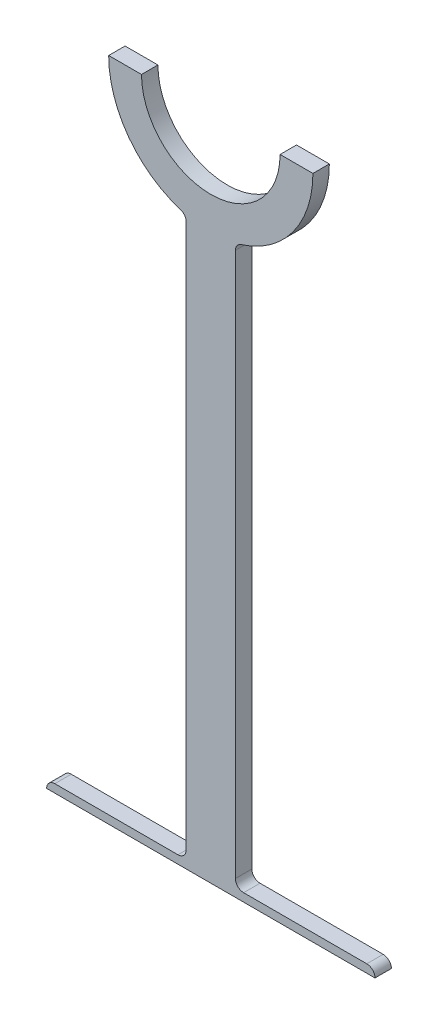
ISO-10303-21;
HEADER;
FILE_DESCRIPTION(('STEP AP214'),'2;1');
FILE_NAME('part.step','',(''),(''),'','','');
FILE_SCHEMA(('AUTOMOTIVE_DESIGN { 1 0 10303 214 1 1 1 1 }'));
ENDSEC;
DATA;
#1=APPLICATION_CONTEXT('core data for automotive mechanical design processes');
#2=APPLICATION_PROTOCOL_DEFINITION('international standard','automotive_design',2000,#1);
#3=PRODUCT_CONTEXT('',#1,'mechanical');
#4=PRODUCT('Part','Part','',(#3));
#5=PRODUCT_RELATED_PRODUCT_CATEGORY('part','',(#4));
#6=PRODUCT_DEFINITION_FORMATION('','',#4);
#7=PRODUCT_DEFINITION_CONTEXT('part definition',#1,'design');
#8=PRODUCT_DEFINITION('design','',#6,#7);
#9=PRODUCT_DEFINITION_SHAPE('','',#8);
#10=(LENGTH_UNIT() NAMED_UNIT(*) SI_UNIT(.MILLI.,.METRE.));
#11=(NAMED_UNIT(*) PLANE_ANGLE_UNIT() SI_UNIT($,.RADIAN.));
#12=(NAMED_UNIT(*) SI_UNIT($,.STERADIAN.) SOLID_ANGLE_UNIT());
#13=UNCERTAINTY_MEASURE_WITH_UNIT(LENGTH_MEASURE(1.E-05),#10,'distance_accuracy_value','');
#14=(GEOMETRIC_REPRESENTATION_CONTEXT(3) GLOBAL_UNCERTAINTY_ASSIGNED_CONTEXT((#13)) GLOBAL_UNIT_ASSIGNED_CONTEXT((#10,
#11,#12)) REPRESENTATION_CONTEXT('',''));
#15=CARTESIAN_POINT('',(0.,0.,0.));
#16=DIRECTION('',(0.,0.,1.));
#17=DIRECTION('',(1.,0.,0.));
#18=AXIS2_PLACEMENT_3D('',#15,#16,#17);
#19=CARTESIAN_POINT('',(0.,0.,2.5));
#20=DIRECTION('',(0.,0.,-1.));
#21=DIRECTION('',(-1.,0.,0.));
#22=AXIS2_PLACEMENT_3D('',#19,#20,#21);
#23=CYLINDRICAL_SURFACE('',#22,31.1);
#24=CARTESIAN_POINT('',(0.,0.,2.5));
#25=DIRECTION('',(0.,0.,1.));
#26=DIRECTION('',(1.,0.,0.));
#27=AXIS2_PLACEMENT_3D('',#24,#25,#26);
#28=CIRCLE('',#27,31.1);
#29=CARTESIAN_POINT('',(9.25595238095238,-29.6906945947976,2.5));
#30=VERTEX_POINT('',#29);
#31=CARTESIAN_POINT('',(31.1,0.,2.5));
#32=VERTEX_POINT('',#31);
#33=EDGE_CURVE('E214',#30,#32,#28,.T.);
#34=ORIENTED_EDGE('',*,*,#33,.F.);
#35=DIRECTION('',(0.,0.,-1.));
#36=VECTOR('',#35,1.);
#37=CARTESIAN_POINT('',(9.25595238095238,-29.6906945947976,2.5));
#38=LINE('',#37,#36);
#39=CARTESIAN_POINT('',(9.25595238095238,-29.6906945947976,-2.5));
#40=VERTEX_POINT('',#39);
#41=EDGE_CURVE('E284',#30,#40,#38,.T.);
#42=ORIENTED_EDGE('',*,*,#41,.T.);
#43=CARTESIAN_POINT('',(0.,0.,-2.5));
#44=DIRECTION('',(0.,0.,1.));
#45=DIRECTION('',(1.,0.,0.));
#46=AXIS2_PLACEMENT_3D('',#43,#44,#45);
#47=CIRCLE('',#46,31.1);
#48=CARTESIAN_POINT('',(31.1,0.,-2.5));
#49=VERTEX_POINT('',#48);
#50=EDGE_CURVE('E229',#40,#49,#47,.T.);
#51=ORIENTED_EDGE('',*,*,#50,.T.);
#52=DIRECTION('',(0.,0.,-1.));
#53=VECTOR('',#52,1.);
#54=CARTESIAN_POINT('',(31.1,0.,2.5));
#55=LINE('',#54,#53);
#56=EDGE_CURVE('E239',#32,#49,#55,.T.);
#57=ORIENTED_EDGE('',*,*,#56,.F.);
#58=EDGE_LOOP('',(#34,#42,#51,#57));
#59=FACE_BOUND('',#58,.T.);
#60=ADVANCED_FACE('F39',(#59),#23,.T.);
#61=CARTESIAN_POINT('',(-31.1,0.,-2.5));
#62=VERTEX_POINT('',#61);
#63=CARTESIAN_POINT('',(-9.25595238095238,-29.6906945947976,-2.5));
#64=VERTEX_POINT('',#63);
#65=EDGE_CURVE('E230',#62,#64,#47,.T.);
#66=ORIENTED_EDGE('',*,*,#65,.T.);
#67=DIRECTION('',(0.,0.,-1.));
#68=VECTOR('',#67,1.);
#69=CARTESIAN_POINT('',(-9.25595238095238,-29.6906945947976,2.5));
#70=LINE('',#69,#68);
#71=CARTESIAN_POINT('',(-9.25595238095238,-29.6906945947976,2.5));
#72=VERTEX_POINT('',#71);
#73=EDGE_CURVE('E297',#64,#72,#70,.F.);
#74=ORIENTED_EDGE('',*,*,#73,.T.);
#75=CARTESIAN_POINT('',(-31.1,0.,2.5));
#76=VERTEX_POINT('',#75);
#77=EDGE_CURVE('E215',#76,#72,#28,.T.);
#78=ORIENTED_EDGE('',*,*,#77,.F.);
#79=DIRECTION('',(0.,0.,-1.));
#80=VECTOR('',#79,1.);
#81=CARTESIAN_POINT('',(-31.1,0.,2.5));
#82=LINE('',#81,#80);
#83=EDGE_CURVE('E243',#76,#62,#82,.T.);
#84=ORIENTED_EDGE('',*,*,#83,.T.);
#85=EDGE_LOOP('',(#66,#74,#78,#84));
#86=FACE_BOUND('',#85,.T.);
#87=ADVANCED_FACE('F356',(#86),#23,.T.);
#88=CARTESIAN_POINT('',(0.,0.,2.5));
#89=DIRECTION('',(0.,0.,-1.));
#90=DIRECTION('',(-1.,0.,0.));
#91=AXIS2_PLACEMENT_3D('',#88,#89,#90);
#92=CYLINDRICAL_SURFACE('',#91,21.1);
#93=CARTESIAN_POINT('',(0.,0.,-2.5));
#94=DIRECTION('',(0.,0.,-1.));
#95=DIRECTION('',(1.,0.,0.));
#96=AXIS2_PLACEMENT_3D('',#93,#94,#95);
#97=CIRCLE('',#96,21.1);
#98=CARTESIAN_POINT('',(21.1,0.,-2.5));
#99=VERTEX_POINT('',#98);
#100=CARTESIAN_POINT('',(-21.1,0.,-2.5));
#101=VERTEX_POINT('',#100);
#102=EDGE_CURVE('E171',#99,#101,#97,.T.);
#103=ORIENTED_EDGE('',*,*,#102,.T.);
#104=DIRECTION('',(0.,0.,-1.));
#105=VECTOR('',#104,1.);
#106=CARTESIAN_POINT('',(-21.1,0.,2.5));
#107=LINE('',#106,#105);
#108=CARTESIAN_POINT('',(-21.1,0.,2.5));
#109=VERTEX_POINT('',#108);
#110=EDGE_CURVE('E247',#109,#101,#107,.T.);
#111=ORIENTED_EDGE('',*,*,#110,.F.);
#112=CARTESIAN_POINT('',(0.,0.,2.5));
#113=DIRECTION('',(0.,0.,-1.));
#114=DIRECTION('',(1.,0.,0.));
#115=AXIS2_PLACEMENT_3D('',#112,#113,#114);
#116=CIRCLE('',#115,21.1);
#117=CARTESIAN_POINT('',(21.1,0.,2.5));
#118=VERTEX_POINT('',#117);
#119=EDGE_CURVE('E206',#118,#109,#116,.T.);
#120=ORIENTED_EDGE('',*,*,#119,.F.);
#121=DIRECTION('',(0.,0.,-1.));
#122=VECTOR('',#121,1.);
#123=CARTESIAN_POINT('',(21.1,0.,2.5));
#124=LINE('',#123,#122);
#125=EDGE_CURVE('E222',#118,#99,#124,.T.);
#126=ORIENTED_EDGE('',*,*,#125,.T.);
#127=EDGE_LOOP('',(#103,#111,#120,#126));
#128=FACE_BOUND('',#127,.T.);
#129=ADVANCED_FACE('F349',(#128),#92,.F.);
#130=CARTESIAN_POINT('',(-21.1,0.,2.5));
#131=DIRECTION('',(0.,-1.,0.));
#132=DIRECTION('',(1.,0.,0.));
#133=AXIS2_PLACEMENT_3D('',#130,#131,#132);
#134=PLANE('',#133);
#135=DIRECTION('',(-1.,0.,0.));
#136=VECTOR('',#135,1.);
#137=CARTESIAN_POINT('',(-21.1,0.,-2.5));
#138=LINE('',#137,#136);
#139=EDGE_CURVE('E226',#101,#62,#138,.T.);
#140=ORIENTED_EDGE('',*,*,#139,.T.);
#141=ORIENTED_EDGE('',*,*,#83,.F.);
#142=DIRECTION('',(-1.,0.,0.));
#143=VECTOR('',#142,1.);
#144=CARTESIAN_POINT('',(-21.1,0.,2.5));
#145=LINE('',#144,#143);
#146=EDGE_CURVE('E210',#109,#76,#145,.T.);
#147=ORIENTED_EDGE('',*,*,#146,.F.);
#148=ORIENTED_EDGE('',*,*,#110,.T.);
#149=EDGE_LOOP('',(#140,#141,#147,#148));
#150=FACE_BOUND('',#149,.T.);
#151=ADVANCED_FACE('F352',(#150),#134,.F.);
#152=CARTESIAN_POINT('',(21.1,0.,2.5));
#153=DIRECTION('',(0.,-1.,0.));
#154=DIRECTION('',(0.,0.,-1.));
#155=AXIS2_PLACEMENT_3D('',#152,#153,#154);
#156=PLANE('',#155);
#157=DIRECTION('',(-1.,0.,0.));
#158=VECTOR('',#157,1.);
#159=CARTESIAN_POINT('',(21.1,0.,-2.5));
#160=LINE('',#159,#158);
#161=EDGE_CURVE('E211',#49,#99,#160,.T.);
#162=ORIENTED_EDGE('',*,*,#161,.T.);
#163=ORIENTED_EDGE('',*,*,#125,.F.);
#164=DIRECTION('',(-1.,0.,0.));
#165=VECTOR('',#164,1.);
#166=CARTESIAN_POINT('',(21.1,0.,2.5));
#167=LINE('',#166,#165);
#168=EDGE_CURVE('E219',#32,#118,#167,.T.);
#169=ORIENTED_EDGE('',*,*,#168,.F.);
#170=ORIENTED_EDGE('',*,*,#56,.T.);
#171=EDGE_LOOP('',(#162,#163,#169,#170));
#172=FACE_BOUND('',#171,.T.);
#173=ADVANCED_FACE('F344',(#172),#156,.F.);
#174=CARTESIAN_POINT('',(0.,0.,2.5));
#175=DIRECTION('',(0.,0.,1.));
#176=DIRECTION('',(1.,0.,0.));
#177=AXIS2_PLACEMENT_3D('',#174,#175,#176);
#178=PLANE('',#177);
#179=DIRECTION('',(1.,0.,0.));
#180=VECTOR('',#179,1.);
#181=CARTESIAN_POINT('',(-50.,-200.239187587837,2.5));
#182=LINE('',#181,#180);
#183=CARTESIAN_POINT('',(-47.5,-200.239187587837,2.5));
#184=VERTEX_POINT('',#183);
#185=CARTESIAN_POINT('',(-10.,-200.239187587837,2.5));
#186=VERTEX_POINT('',#185);
#187=EDGE_CURVE('E184',#184,#186,#182,.T.);
#188=ORIENTED_EDGE('',*,*,#187,.F.);
#189=CARTESIAN_POINT('',(-47.5,-202.739187587837,2.5));
#190=DIRECTION('',(0.,0.,1.));
#191=DIRECTION('',(1.,0.,0.));
#192=AXIS2_PLACEMENT_3D('',#189,#190,#191);
#193=CIRCLE('',#192,2.5);
#194=CARTESIAN_POINT('',(-50.,-202.739187587837,2.5));
#195=VERTEX_POINT('',#194);
#196=EDGE_CURVE('E48',#184,#195,#193,.T.);
#197=ORIENTED_EDGE('',*,*,#196,.T.);
#198=DIRECTION('',(1.,0.,0.));
#199=VECTOR('',#198,1.);
#200=CARTESIAN_POINT('',(-7.5,-202.739187587837,2.5));
#201=LINE('',#200,#199);
#202=CARTESIAN_POINT('',(50.,-202.739187587837,2.5));
#203=VERTEX_POINT('',#202);
#204=EDGE_CURVE('E165',#195,#203,#201,.T.);
#205=ORIENTED_EDGE('',*,*,#204,.T.);
#206=CARTESIAN_POINT('',(47.5,-202.739187587837,2.5));
#207=DIRECTION('',(0.,0.,1.));
#208=DIRECTION('',(1.,0.,0.));
#209=AXIS2_PLACEMENT_3D('',#206,#207,#208);
#210=CIRCLE('',#209,2.5);
#211=CARTESIAN_POINT('',(47.5,-200.239187587837,2.5));
#212=VERTEX_POINT('',#211);
#213=EDGE_CURVE('E151',#203,#212,#210,.T.);
#214=ORIENTED_EDGE('',*,*,#213,.T.);
#215=CARTESIAN_POINT('',(10.,-200.239187587837,2.5));
#216=VERTEX_POINT('',#215);
#217=EDGE_CURVE('E188',#216,#212,#182,.T.);
#218=ORIENTED_EDGE('',*,*,#217,.F.);
#219=CARTESIAN_POINT('',(10.,-197.739187587837,2.5));
#220=DIRECTION('',(0.,0.,1.));
#221=DIRECTION('',(1.,0.,0.));
#222=AXIS2_PLACEMENT_3D('',#219,#220,#221);
#223=CIRCLE('',#222,2.5);
#224=CARTESIAN_POINT('',(7.5,-197.739187587837,2.5));
#225=VERTEX_POINT('',#224);
#226=EDGE_CURVE('E261',#216,#225,#223,.F.);
#227=ORIENTED_EDGE('',*,*,#226,.T.);
#228=DIRECTION('',(0.,1.,0.));
#229=VECTOR('',#228,1.);
#230=CARTESIAN_POINT('',(7.5,-202.739187587837,2.5));
#231=LINE('',#230,#229);
#232=CARTESIAN_POINT('',(7.5,-32.0774063789453,2.5));
#233=VERTEX_POINT('',#232);
#234=EDGE_CURVE('E192',#225,#233,#231,.T.);
#235=ORIENTED_EDGE('',*,*,#234,.T.);
#236=CARTESIAN_POINT('',(10.,-32.0774063789453,2.5));
#237=DIRECTION('',(0.,0.,1.));
#238=DIRECTION('',(1.,0.,0.));
#239=AXIS2_PLACEMENT_3D('',#236,#237,#238);
#240=CIRCLE('',#239,2.5);
#241=EDGE_CURVE('E287',#233,#30,#240,.F.);
#242=ORIENTED_EDGE('',*,*,#241,.T.);
#243=ORIENTED_EDGE('',*,*,#33,.T.);
#244=ORIENTED_EDGE('',*,*,#168,.T.);
#245=ORIENTED_EDGE('',*,*,#119,.T.);
#246=ORIENTED_EDGE('',*,*,#146,.T.);
#247=ORIENTED_EDGE('',*,*,#77,.T.);
#248=CARTESIAN_POINT('',(-10.,-32.0774063789453,2.5));
#249=DIRECTION('',(0.,0.,1.));
#250=DIRECTION('',(1.,0.,0.));
#251=AXIS2_PLACEMENT_3D('',#248,#249,#250);
#252=CIRCLE('',#251,2.5);
#253=CARTESIAN_POINT('',(-7.5,-32.0774063789453,2.5));
#254=VERTEX_POINT('',#253);
#255=EDGE_CURVE('E162',#72,#254,#252,.F.);
#256=ORIENTED_EDGE('',*,*,#255,.T.);
#257=DIRECTION('',(0.,-1.,0.));
#258=VECTOR('',#257,1.);
#259=CARTESIAN_POINT('',(-7.5,-202.739187587837,2.5));
#260=LINE('',#259,#258);
#261=CARTESIAN_POINT('',(-7.5,-197.739187587837,2.5));
#262=VERTEX_POINT('',#261);
#263=EDGE_CURVE('E172',#254,#262,#260,.T.);
#264=ORIENTED_EDGE('',*,*,#263,.T.);
#265=CARTESIAN_POINT('',(-10.,-197.739187587837,2.5));
#266=DIRECTION('',(0.,0.,1.));
#267=DIRECTION('',(1.,0.,0.));
#268=AXIS2_PLACEMENT_3D('',#265,#266,#267);
#269=CIRCLE('',#268,2.5);
#270=EDGE_CURVE('E272',#262,#186,#269,.F.);
#271=ORIENTED_EDGE('',*,*,#270,.T.);
#272=EDGE_LOOP('',(#188,#197,#205,#214,#218,#227,#235,#242,#243,#244,#245,#246,#247,#256,#264,#271));
#273=FACE_BOUND('',#272,.T.);
#274=ADVANCED_FACE('F167',(#273),#178,.T.);
#275=CARTESIAN_POINT('',(0.,0.,-2.5));
#276=DIRECTION('',(0.,0.,1.));
#277=DIRECTION('',(1.,0.,0.));
#278=AXIS2_PLACEMENT_3D('',#275,#276,#277);
#279=PLANE('',#278);
#280=DIRECTION('',(1.,0.,0.));
#281=VECTOR('',#280,1.);
#282=CARTESIAN_POINT('',(-7.5,-202.739187587837,-2.5));
#283=LINE('',#282,#281);
#284=CARTESIAN_POINT('',(-50.,-202.739187587837,-2.5));
#285=VERTEX_POINT('',#284);
#286=CARTESIAN_POINT('',(50.,-202.739187587837,-2.5));
#287=VERTEX_POINT('',#286);
#288=EDGE_CURVE('E176',#285,#287,#283,.T.);
#289=ORIENTED_EDGE('',*,*,#288,.F.);
#290=CARTESIAN_POINT('',(-47.5,-202.739187587837,-2.5));
#291=DIRECTION('',(0.,0.,1.));
#292=DIRECTION('',(1.,0.,0.));
#293=AXIS2_PLACEMENT_3D('',#290,#291,#292);
#294=CIRCLE('',#293,2.5);
#295=CARTESIAN_POINT('',(-47.5,-200.239187587837,-2.5));
#296=VERTEX_POINT('',#295);
#297=EDGE_CURVE('E11',#285,#296,#294,.F.);
#298=ORIENTED_EDGE('',*,*,#297,.T.);
#299=DIRECTION('',(1.,0.,0.));
#300=VECTOR('',#299,1.);
#301=CARTESIAN_POINT('',(-50.,-200.239187587837,-2.5));
#302=LINE('',#301,#300);
#303=CARTESIAN_POINT('',(-10.,-200.239187587837,-2.5));
#304=VERTEX_POINT('',#303);
#305=EDGE_CURVE('E189',#296,#304,#302,.T.);
#306=ORIENTED_EDGE('',*,*,#305,.T.);
#307=CARTESIAN_POINT('',(-10.,-197.739187587837,-2.5));
#308=DIRECTION('',(0.,0.,1.));
#309=DIRECTION('',(1.,0.,0.));
#310=AXIS2_PLACEMENT_3D('',#307,#308,#309);
#311=CIRCLE('',#310,2.5);
#312=CARTESIAN_POINT('',(-7.5,-197.739187587837,-2.5));
#313=VERTEX_POINT('',#312);
#314=EDGE_CURVE('E276',#304,#313,#311,.T.);
#315=ORIENTED_EDGE('',*,*,#314,.T.);
#316=DIRECTION('',(0.,-1.,0.));
#317=VECTOR('',#316,1.);
#318=CARTESIAN_POINT('',(-7.5,-202.739187587837,-2.5));
#319=LINE('',#318,#317);
#320=CARTESIAN_POINT('',(-7.5,-32.0774063789453,-2.5));
#321=VERTEX_POINT('',#320);
#322=EDGE_CURVE('E201',#321,#313,#319,.T.);
#323=ORIENTED_EDGE('',*,*,#322,.F.);
#324=CARTESIAN_POINT('',(-10.,-32.0774063789453,-2.5));
#325=DIRECTION('',(0.,0.,1.));
#326=DIRECTION('',(1.,0.,0.));
#327=AXIS2_PLACEMENT_3D('',#324,#325,#326);
#328=CIRCLE('',#327,2.5);
#329=EDGE_CURVE('E300',#321,#64,#328,.T.);
#330=ORIENTED_EDGE('',*,*,#329,.T.);
#331=ORIENTED_EDGE('',*,*,#65,.F.);
#332=ORIENTED_EDGE('',*,*,#139,.F.);
#333=ORIENTED_EDGE('',*,*,#102,.F.);
#334=ORIENTED_EDGE('',*,*,#161,.F.);
#335=ORIENTED_EDGE('',*,*,#50,.F.);
#336=CARTESIAN_POINT('',(10.,-32.0774063789453,-2.5));
#337=DIRECTION('',(0.,0.,1.));
#338=DIRECTION('',(1.,0.,0.));
#339=AXIS2_PLACEMENT_3D('',#336,#337,#338);
#340=CIRCLE('',#339,2.5);
#341=CARTESIAN_POINT('',(7.5,-32.0774063789453,-2.5));
#342=VERTEX_POINT('',#341);
#343=EDGE_CURVE('E290',#40,#342,#340,.T.);
#344=ORIENTED_EDGE('',*,*,#343,.T.);
#345=DIRECTION('',(0.,1.,0.));
#346=VECTOR('',#345,1.);
#347=CARTESIAN_POINT('',(7.5,-202.739187587837,-2.5));
#348=LINE('',#347,#346);
#349=CARTESIAN_POINT('',(7.5,-197.739187587837,-2.5));
#350=VERTEX_POINT('',#349);
#351=EDGE_CURVE('E187',#350,#342,#348,.T.);
#352=ORIENTED_EDGE('',*,*,#351,.F.);
#353=CARTESIAN_POINT('',(10.,-197.739187587837,-2.5));
#354=DIRECTION('',(0.,0.,1.));
#355=DIRECTION('',(1.,0.,0.));
#356=AXIS2_PLACEMENT_3D('',#353,#354,#355);
#357=CIRCLE('',#356,2.5);
#358=CARTESIAN_POINT('',(10.,-200.239187587837,-2.5));
#359=VERTEX_POINT('',#358);
#360=EDGE_CURVE('E258',#350,#359,#357,.T.);
#361=ORIENTED_EDGE('',*,*,#360,.T.);
#362=CARTESIAN_POINT('',(47.5,-200.239187587837,-2.5));
#363=VERTEX_POINT('',#362);
#364=EDGE_CURVE('E181',#359,#363,#302,.T.);
#365=ORIENTED_EDGE('',*,*,#364,.T.);
#366=CARTESIAN_POINT('',(47.5,-202.739187587837,-2.5));
#367=DIRECTION('',(0.,0.,1.));
#368=DIRECTION('',(1.,0.,0.));
#369=AXIS2_PLACEMENT_3D('',#366,#367,#368);
#370=CIRCLE('',#369,2.5);
#371=EDGE_CURVE('E307',#363,#287,#370,.F.);
#372=ORIENTED_EDGE('',*,*,#371,.T.);
#373=EDGE_LOOP('',(#289,#298,#306,#315,#323,#330,#331,#332,#333,#334,#335,#344,#352,#361,#365,#372));
#374=FACE_BOUND('',#373,.T.);
#375=ADVANCED_FACE('F319',(#374),#279,.F.);
#376=CARTESIAN_POINT('',(7.5,-202.739187587837,2.5));
#377=DIRECTION('',(-1.,0.,0.));
#378=DIRECTION('',(0.,0.,1.));
#379=AXIS2_PLACEMENT_3D('',#376,#377,#378);
#380=PLANE('',#379);
#381=ORIENTED_EDGE('',*,*,#351,.T.);
#382=DIRECTION('',(0.,0.,1.));
#383=VECTOR('',#382,1.);
#384=CARTESIAN_POINT('',(7.5,-32.0774063789453,2.5));
#385=LINE('',#384,#383);
#386=EDGE_CURVE('E280',#342,#233,#385,.T.);
#387=ORIENTED_EDGE('',*,*,#386,.T.);
#388=ORIENTED_EDGE('',*,*,#234,.F.);
#389=DIRECTION('',(0.,0.,-1.));
#390=VECTOR('',#389,1.);
#391=CARTESIAN_POINT('',(7.5,-197.739187587837,2.5));
#392=LINE('',#391,#390);
#393=EDGE_CURVE('E251',#225,#350,#392,.T.);
#394=ORIENTED_EDGE('',*,*,#393,.T.);
#395=EDGE_LOOP('',(#381,#387,#388,#394));
#396=FACE_BOUND('',#395,.T.);
#397=ADVANCED_FACE('F330',(#396),#380,.F.);
#398=CARTESIAN_POINT('',(-7.5,-202.739187587837,2.5));
#399=DIRECTION('',(1.,0.,0.));
#400=DIRECTION('',(0.,0.,-1.));
#401=AXIS2_PLACEMENT_3D('',#398,#399,#400);
#402=PLANE('',#401);
#403=ORIENTED_EDGE('',*,*,#263,.F.);
#404=DIRECTION('',(0.,0.,1.));
#405=VECTOR('',#404,1.);
#406=CARTESIAN_POINT('',(-7.5,-32.0774063789453,-2.5));
#407=LINE('',#406,#405);
#408=EDGE_CURVE('E293',#254,#321,#407,.F.);
#409=ORIENTED_EDGE('',*,*,#408,.T.);
#410=ORIENTED_EDGE('',*,*,#322,.T.);
#411=DIRECTION('',(0.,0.,1.));
#412=VECTOR('',#411,1.);
#413=CARTESIAN_POINT('',(-7.5,-197.739187587837,2.5));
#414=LINE('',#413,#412);
#415=EDGE_CURVE('E264',#313,#262,#414,.T.);
#416=ORIENTED_EDGE('',*,*,#415,.T.);
#417=EDGE_LOOP('',(#403,#409,#410,#416));
#418=FACE_BOUND('',#417,.T.);
#419=ADVANCED_FACE('F365',(#418),#402,.F.);
#420=CARTESIAN_POINT('',(-7.5,-202.739187587837,2.5));
#421=DIRECTION('',(0.,1.,0.));
#422=DIRECTION('',(0.,0.,1.));
#423=AXIS2_PLACEMENT_3D('',#420,#421,#422);
#424=PLANE('',#423);
#425=ORIENTED_EDGE('',*,*,#288,.T.);
#426=DIRECTION('',(0.,0.,-1.));
#427=VECTOR('',#426,1.);
#428=CARTESIAN_POINT('',(50.,-202.739187587837,2.5));
#429=LINE('',#428,#427);
#430=EDGE_CURVE('E156',#203,#287,#429,.T.);
#431=ORIENTED_EDGE('',*,*,#430,.F.);
#432=ORIENTED_EDGE('',*,*,#204,.F.);
#433=DIRECTION('',(0.,0.,-1.));
#434=VECTOR('',#433,1.);
#435=CARTESIAN_POINT('',(-50.,-202.739187587837,2.5));
#436=LINE('',#435,#434);
#437=EDGE_CURVE('E178',#195,#285,#436,.T.);
#438=ORIENTED_EDGE('',*,*,#437,.T.);
#439=EDGE_LOOP('',(#425,#431,#432,#438));
#440=FACE_BOUND('',#439,.T.);
#441=ADVANCED_FACE('F175',(#440),#424,.F.);
#442=CARTESIAN_POINT('',(-50.,-200.239187587837,2.5));
#443=DIRECTION('',(0.,1.,0.));
#444=DIRECTION('',(0.,0.,1.));
#445=AXIS2_PLACEMENT_3D('',#442,#443,#444);
#446=PLANE('',#445);
#447=ORIENTED_EDGE('',*,*,#305,.F.);
#448=DIRECTION('',(0.,0.,1.));
#449=VECTOR('',#448,1.);
#450=CARTESIAN_POINT('',(-47.5,-200.239187587837,2.5));
#451=LINE('',#450,#449);
#452=EDGE_CURVE('E310',#296,#184,#451,.T.);
#453=ORIENTED_EDGE('',*,*,#452,.T.);
#454=ORIENTED_EDGE('',*,*,#187,.T.);
#455=DIRECTION('',(0.,0.,1.));
#456=VECTOR('',#455,1.);
#457=CARTESIAN_POINT('',(-10.,-200.239187587837,2.5));
#458=LINE('',#457,#456);
#459=EDGE_CURVE('E268',#186,#304,#458,.F.);
#460=ORIENTED_EDGE('',*,*,#459,.T.);
#461=EDGE_LOOP('',(#447,#453,#454,#460));
#462=FACE_BOUND('',#461,.T.);
#463=ADVANCED_FACE('F373',(#462),#446,.T.);
#464=ORIENTED_EDGE('',*,*,#217,.T.);
#465=DIRECTION('',(0.,0.,1.));
#466=VECTOR('',#465,1.);
#467=CARTESIAN_POINT('',(47.5,-200.239187587837,-2.5));
#468=LINE('',#467,#466);
#469=EDGE_CURVE('E157',#212,#363,#468,.F.);
#470=ORIENTED_EDGE('',*,*,#469,.T.);
#471=ORIENTED_EDGE('',*,*,#364,.F.);
#472=DIRECTION('',(0.,0.,-1.));
#473=VECTOR('',#472,1.);
#474=CARTESIAN_POINT('',(10.,-200.239187587837,2.5));
#475=LINE('',#474,#473);
#476=EDGE_CURVE('E255',#359,#216,#475,.F.);
#477=ORIENTED_EDGE('',*,*,#476,.T.);
#478=EDGE_LOOP('',(#464,#470,#471,#477));
#479=FACE_BOUND('',#478,.T.);
#480=ADVANCED_FACE('F323',(#479),#446,.T.);
#481=CARTESIAN_POINT('',(10.,-197.739187587837,2.5));
#482=DIRECTION('',(0.,0.,-1.));
#483=DIRECTION('',(-1.,0.,0.));
#484=AXIS2_PLACEMENT_3D('',#481,#482,#483);
#485=CYLINDRICAL_SURFACE('',#484,2.5);
#486=ORIENTED_EDGE('',*,*,#226,.F.);
#487=ORIENTED_EDGE('',*,*,#476,.F.);
#488=ORIENTED_EDGE('',*,*,#360,.F.);
#489=ORIENTED_EDGE('',*,*,#393,.F.);
#490=EDGE_LOOP('',(#486,#487,#488,#489));
#491=FACE_BOUND('',#490,.T.);
#492=ADVANCED_FACE('F326',(#491),#485,.F.);
#493=CARTESIAN_POINT('',(-10.,-197.739187587837,2.5));
#494=DIRECTION('',(0.,0.,1.));
#495=DIRECTION('',(1.,0.,0.));
#496=AXIS2_PLACEMENT_3D('',#493,#494,#495);
#497=CYLINDRICAL_SURFACE('',#496,2.5);
#498=ORIENTED_EDGE('',*,*,#314,.F.);
#499=ORIENTED_EDGE('',*,*,#459,.F.);
#500=ORIENTED_EDGE('',*,*,#270,.F.);
#501=ORIENTED_EDGE('',*,*,#415,.F.);
#502=EDGE_LOOP('',(#498,#499,#500,#501));
#503=FACE_BOUND('',#502,.T.);
#504=ADVANCED_FACE('F371',(#503),#497,.F.);
#505=CARTESIAN_POINT('',(10.,-32.0774063789453,2.5));
#506=DIRECTION('',(0.,0.,-1.));
#507=DIRECTION('',(-1.,0.,0.));
#508=AXIS2_PLACEMENT_3D('',#505,#506,#507);
#509=CYLINDRICAL_SURFACE('',#508,2.5);
#510=ORIENTED_EDGE('',*,*,#343,.F.);
#511=ORIENTED_EDGE('',*,*,#41,.F.);
#512=ORIENTED_EDGE('',*,*,#241,.F.);
#513=ORIENTED_EDGE('',*,*,#386,.F.);
#514=EDGE_LOOP('',(#510,#511,#512,#513));
#515=FACE_BOUND('',#514,.T.);
#516=ADVANCED_FACE('F334',(#515),#509,.F.);
#517=CARTESIAN_POINT('',(-10.,-32.0774063789453,2.5));
#518=DIRECTION('',(0.,0.,-1.));
#519=DIRECTION('',(-1.,0.,0.));
#520=AXIS2_PLACEMENT_3D('',#517,#518,#519);
#521=CYLINDRICAL_SURFACE('',#520,2.5);
#522=ORIENTED_EDGE('',*,*,#255,.F.);
#523=ORIENTED_EDGE('',*,*,#73,.F.);
#524=ORIENTED_EDGE('',*,*,#329,.F.);
#525=ORIENTED_EDGE('',*,*,#408,.F.);
#526=EDGE_LOOP('',(#522,#523,#524,#525));
#527=FACE_BOUND('',#526,.T.);
#528=ADVANCED_FACE('F362',(#527),#521,.F.);
#529=CARTESIAN_POINT('',(47.5,-202.739187587837,0.));
#530=DIRECTION('',(0.,0.,-1.));
#531=DIRECTION('',(-1.,0.,0.));
#532=AXIS2_PLACEMENT_3D('',#529,#530,#531);
#533=CYLINDRICAL_SURFACE('',#532,2.5);
#534=ORIENTED_EDGE('',*,*,#371,.F.);
#535=ORIENTED_EDGE('',*,*,#469,.F.);
#536=ORIENTED_EDGE('',*,*,#213,.F.);
#537=ORIENTED_EDGE('',*,*,#430,.T.);
#538=EDGE_LOOP('',(#534,#535,#536,#537));
#539=FACE_BOUND('',#538,.T.);
#540=ADVANCED_FACE('F154',(#539),#533,.T.);
#541=CARTESIAN_POINT('',(-47.5,-202.739187587837,2.5));
#542=DIRECTION('',(0.,0.,1.));
#543=DIRECTION('',(1.,0.,0.));
#544=AXIS2_PLACEMENT_3D('',#541,#542,#543);
#545=CYLINDRICAL_SURFACE('',#544,2.5);
#546=ORIENTED_EDGE('',*,*,#297,.F.);
#547=ORIENTED_EDGE('',*,*,#437,.F.);
#548=ORIENTED_EDGE('',*,*,#196,.F.);
#549=ORIENTED_EDGE('',*,*,#452,.F.);
#550=EDGE_LOOP('',(#546,#547,#548,#549));
#551=FACE_BOUND('',#550,.T.);
#552=ADVANCED_FACE('F41',(#551),#545,.T.);
#553=CLOSED_SHELL('',(#60,#87,#129,#151,#173,#274,#375,#397,#419,#441,#463,#480,#492,#504,#516,
#528,#540,#552));
#554=MANIFOLD_SOLID_BREP('B2',#553);
#555=ADVANCED_BREP_SHAPE_REPRESENTATION('',(#18,#554),#14);
#556=SHAPE_DEFINITION_REPRESENTATION(#9,#555);
ENDSEC;
END-ISO-10303-21;
